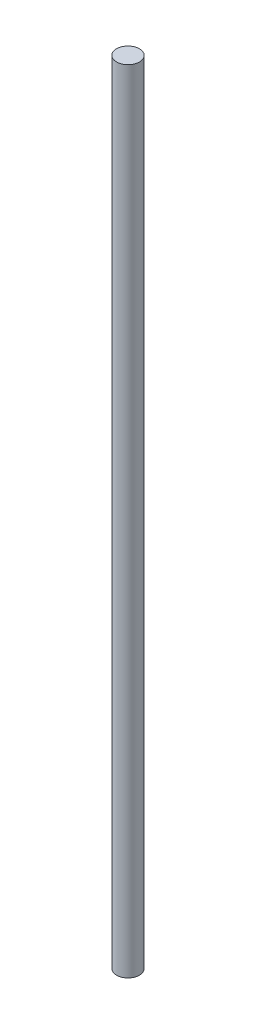
ISO-10303-21;
HEADER;
FILE_DESCRIPTION(('STEP AP214'),'2;1');
FILE_NAME('part.step','',(''),(''),'','','');
FILE_SCHEMA(('AUTOMOTIVE_DESIGN { 1 0 10303 214 1 1 1 1 }'));
ENDSEC;
DATA;
#1=APPLICATION_CONTEXT('core data for automotive mechanical design processes');
#2=APPLICATION_PROTOCOL_DEFINITION('international standard','automotive_design',2000,#1);
#3=PRODUCT_CONTEXT('',#1,'mechanical');
#4=PRODUCT('Part','Part','',(#3));
#5=PRODUCT_RELATED_PRODUCT_CATEGORY('part','',(#4));
#6=PRODUCT_DEFINITION_FORMATION('','',#4);
#7=PRODUCT_DEFINITION_CONTEXT('part definition',#1,'design');
#8=PRODUCT_DEFINITION('design','',#6,#7);
#9=PRODUCT_DEFINITION_SHAPE('','',#8);
#10=(LENGTH_UNIT() NAMED_UNIT(*) SI_UNIT(.MILLI.,.METRE.));
#11=(NAMED_UNIT(*) PLANE_ANGLE_UNIT() SI_UNIT($,.RADIAN.));
#12=(NAMED_UNIT(*) SI_UNIT($,.STERADIAN.) SOLID_ANGLE_UNIT());
#13=UNCERTAINTY_MEASURE_WITH_UNIT(LENGTH_MEASURE(1.E-05),#10,'distance_accuracy_value','');
#14=(GEOMETRIC_REPRESENTATION_CONTEXT(3) GLOBAL_UNCERTAINTY_ASSIGNED_CONTEXT((#13)) GLOBAL_UNIT_ASSIGNED_CONTEXT((#10,
#11,#12)) REPRESENTATION_CONTEXT('',''));
#15=CARTESIAN_POINT('',(0.,0.,0.));
#16=DIRECTION('',(0.,0.,1.));
#17=DIRECTION('',(1.,0.,0.));
#18=AXIS2_PLACEMENT_3D('',#15,#16,#17);
#19=CARTESIAN_POINT('',(0.,32.5,0.));
#20=DIRECTION('',(0.,-1.,0.));
#21=DIRECTION('',(0.,0.,-1.));
#22=AXIS2_PLACEMENT_3D('',#19,#20,#21);
#23=CYLINDRICAL_SURFACE('',#22,0.94);
#24=CARTESIAN_POINT('',(0.,32.5,0.));
#25=DIRECTION('',(0.,1.,0.));
#26=DIRECTION('',(0.,0.,1.));
#27=AXIS2_PLACEMENT_3D('',#24,#25,#26);
#28=CIRCLE('',#27,0.94);
#29=CARTESIAN_POINT('',(0.,32.5,0.94));
#30=VERTEX_POINT('',#29);
#31=EDGE_CURVE('E10',#30,#30,#28,.T.);
#32=ORIENTED_EDGE('',*,*,#31,.F.);
#33=EDGE_LOOP('',(#32));
#34=FACE_BOUND('',#33,.T.);
#35=CARTESIAN_POINT('',(0.,-32.5,0.));
#36=DIRECTION('',(0.,1.,0.));
#37=DIRECTION('',(0.,0.,1.));
#38=AXIS2_PLACEMENT_3D('',#35,#36,#37);
#39=CIRCLE('',#38,0.94);
#40=CARTESIAN_POINT('',(0.,-32.5,0.94));
#41=VERTEX_POINT('',#40);
#42=EDGE_CURVE('E39',#41,#41,#39,.T.);
#43=ORIENTED_EDGE('',*,*,#42,.T.);
#44=EDGE_LOOP('',(#43));
#45=FACE_BOUND('',#44,.T.);
#46=ADVANCED_FACE('F36',(#34,#45),#23,.T.);
#47=CARTESIAN_POINT('',(0.,32.5,0.));
#48=DIRECTION('',(0.,1.,0.));
#49=DIRECTION('',(0.,0.,1.));
#50=AXIS2_PLACEMENT_3D('',#47,#48,#49);
#51=PLANE('',#50);
#52=ORIENTED_EDGE('',*,*,#31,.T.);
#53=EDGE_LOOP('',(#52));
#54=FACE_BOUND('',#53,.T.);
#55=ADVANCED_FACE('F55',(#54),#51,.T.);
#56=CARTESIAN_POINT('',(0.,-32.5,0.));
#57=DIRECTION('',(0.,1.,0.));
#58=DIRECTION('',(0.,0.,1.));
#59=AXIS2_PLACEMENT_3D('',#56,#57,#58);
#60=PLANE('',#59);
#61=ORIENTED_EDGE('',*,*,#42,.F.);
#62=EDGE_LOOP('',(#61));
#63=FACE_BOUND('',#62,.T.);
#64=ADVANCED_FACE('F53',(#63),#60,.F.);
#65=CLOSED_SHELL('',(#46,#55,#64));
#66=MANIFOLD_SOLID_BREP('B2',#65);
#67=ADVANCED_BREP_SHAPE_REPRESENTATION('',(#18,#66),#14);
#68=SHAPE_DEFINITION_REPRESENTATION(#9,#67);
ENDSEC;
END-ISO-10303-21;
